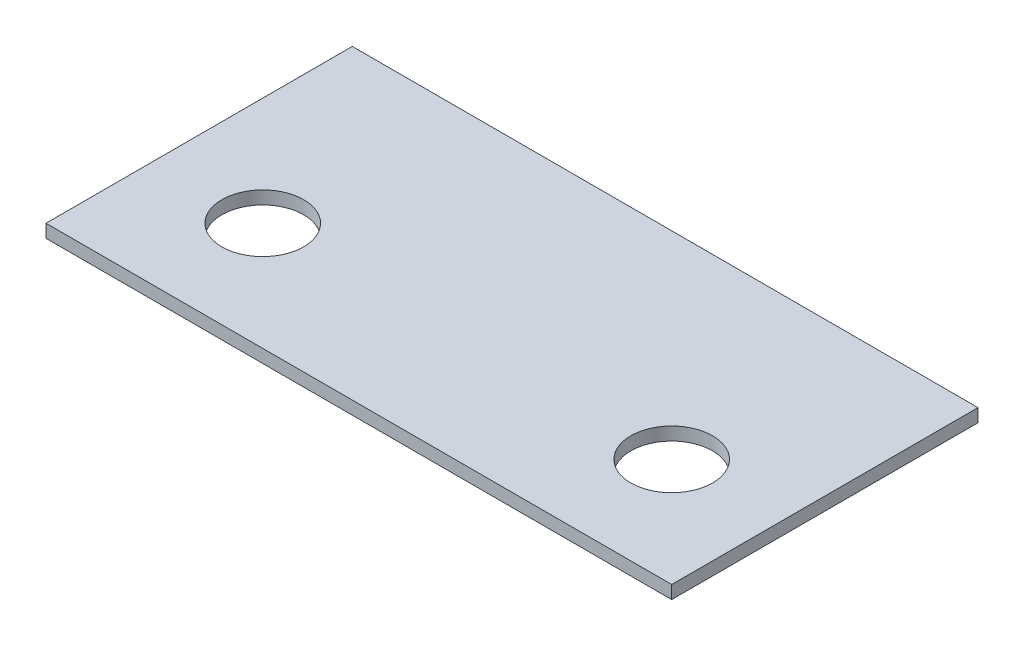
ISO-10303-21;
HEADER;
FILE_DESCRIPTION(('STEP AP214'),'2;1');
FILE_NAME('part.step','',(''),(''),'','','');
FILE_SCHEMA(('AUTOMOTIVE_DESIGN { 1 0 10303 214 1 1 1 1 }'));
ENDSEC;
DATA;
#1=APPLICATION_CONTEXT('core data for automotive mechanical design processes');
#2=APPLICATION_PROTOCOL_DEFINITION('international standard','automotive_design',2000,#1);
#3=PRODUCT_CONTEXT('',#1,'mechanical');
#4=PRODUCT('Part','Part','',(#3));
#5=PRODUCT_RELATED_PRODUCT_CATEGORY('part','',(#4));
#6=PRODUCT_DEFINITION_FORMATION('','',#4);
#7=PRODUCT_DEFINITION_CONTEXT('part definition',#1,'design');
#8=PRODUCT_DEFINITION('design','',#6,#7);
#9=PRODUCT_DEFINITION_SHAPE('','',#8);
#10=(LENGTH_UNIT() NAMED_UNIT(*) SI_UNIT(.MILLI.,.METRE.));
#11=(NAMED_UNIT(*) PLANE_ANGLE_UNIT() SI_UNIT($,.RADIAN.));
#12=(NAMED_UNIT(*) SI_UNIT($,.STERADIAN.) SOLID_ANGLE_UNIT());
#13=UNCERTAINTY_MEASURE_WITH_UNIT(LENGTH_MEASURE(1.E-05),#10,'distance_accuracy_value','');
#14=(GEOMETRIC_REPRESENTATION_CONTEXT(3) GLOBAL_UNCERTAINTY_ASSIGNED_CONTEXT((#13)) GLOBAL_UNIT_ASSIGNED_CONTEXT((#10,
#11,#12)) REPRESENTATION_CONTEXT('',''));
#15=CARTESIAN_POINT('',(0.,0.,0.));
#16=DIRECTION('',(0.,0.,1.));
#17=DIRECTION('',(1.,0.,0.));
#18=AXIS2_PLACEMENT_3D('',#15,#16,#17);
#19=CARTESIAN_POINT('',(382.5,16.,-187.25));
#20=DIRECTION('',(-1.,0.,0.));
#21=DIRECTION('',(0.,0.,1.));
#22=AXIS2_PLACEMENT_3D('',#19,#20,#21);
#23=PLANE('',#22);
#24=DIRECTION('',(0.,0.,-1.));
#25=VECTOR('',#24,1.);
#26=CARTESIAN_POINT('',(382.5,0.,-187.25));
#27=LINE('',#26,#25);
#28=CARTESIAN_POINT('',(382.5,0.,187.25));
#29=VERTEX_POINT('',#28);
#30=CARTESIAN_POINT('',(382.5,0.,-187.25));
#31=VERTEX_POINT('',#30);
#32=EDGE_CURVE('E95',#29,#31,#27,.T.);
#33=ORIENTED_EDGE('',*,*,#32,.T.);
#34=DIRECTION('',(0.,-1.,0.));
#35=VECTOR('',#34,1.);
#36=CARTESIAN_POINT('',(382.5,16.,-187.25));
#37=LINE('',#36,#35);
#38=CARTESIAN_POINT('',(382.5,16.,-187.25));
#39=VERTEX_POINT('',#38);
#40=EDGE_CURVE('E11',#39,#31,#37,.T.);
#41=ORIENTED_EDGE('',*,*,#40,.F.);
#42=DIRECTION('',(0.,0.,-1.));
#43=VECTOR('',#42,1.);
#44=CARTESIAN_POINT('',(382.5,16.,-187.25));
#45=LINE('',#44,#43);
#46=CARTESIAN_POINT('',(382.5,16.,187.25));
#47=VERTEX_POINT('',#46);
#48=EDGE_CURVE('E83',#47,#39,#45,.T.);
#49=ORIENTED_EDGE('',*,*,#48,.F.);
#50=DIRECTION('',(0.,-1.,0.));
#51=VECTOR('',#50,1.);
#52=CARTESIAN_POINT('',(382.5,16.,187.25));
#53=LINE('',#52,#51);
#54=EDGE_CURVE('E91',#47,#29,#53,.T.);
#55=ORIENTED_EDGE('',*,*,#54,.T.);
#56=EDGE_LOOP('',(#33,#41,#49,#55));
#57=FACE_BOUND('',#56,.T.);
#58=ADVANCED_FACE('F32',(#57),#23,.F.);
#59=CARTESIAN_POINT('',(-382.5,16.,-187.25));
#60=DIRECTION('',(0.,0.,1.));
#61=DIRECTION('',(1.,0.,0.));
#62=AXIS2_PLACEMENT_3D('',#59,#60,#61);
#63=PLANE('',#62);
#64=DIRECTION('',(-1.,0.,0.));
#65=VECTOR('',#64,1.);
#66=CARTESIAN_POINT('',(-382.5,0.,-187.25));
#67=LINE('',#66,#65);
#68=CARTESIAN_POINT('',(-382.5,0.,-187.25));
#69=VERTEX_POINT('',#68);
#70=EDGE_CURVE('E87',#31,#69,#67,.T.);
#71=ORIENTED_EDGE('',*,*,#70,.T.);
#72=DIRECTION('',(0.,-1.,0.));
#73=VECTOR('',#72,1.);
#74=CARTESIAN_POINT('',(-382.5,16.,-187.25));
#75=LINE('',#74,#73);
#76=CARTESIAN_POINT('',(-382.5,16.,-187.25));
#77=VERTEX_POINT('',#76);
#78=EDGE_CURVE('E40',#77,#69,#75,.T.);
#79=ORIENTED_EDGE('',*,*,#78,.F.);
#80=DIRECTION('',(-1.,0.,0.));
#81=VECTOR('',#80,1.);
#82=CARTESIAN_POINT('',(-382.5,16.,-187.25));
#83=LINE('',#82,#81);
#84=EDGE_CURVE('E78',#39,#77,#83,.T.);
#85=ORIENTED_EDGE('',*,*,#84,.F.);
#86=ORIENTED_EDGE('',*,*,#40,.T.);
#87=EDGE_LOOP('',(#71,#79,#85,#86));
#88=FACE_BOUND('',#87,.T.);
#89=ADVANCED_FACE('F86',(#88),#63,.F.);
#90=CARTESIAN_POINT('',(-382.5,16.,-187.25));
#91=DIRECTION('',(1.,0.,0.));
#92=DIRECTION('',(0.,0.,-1.));
#93=AXIS2_PLACEMENT_3D('',#90,#91,#92);
#94=PLANE('',#93);
#95=DIRECTION('',(0.,0.,1.));
#96=VECTOR('',#95,1.);
#97=CARTESIAN_POINT('',(-382.5,0.,-187.25));
#98=LINE('',#97,#96);
#99=CARTESIAN_POINT('',(-382.5,0.,187.25));
#100=VERTEX_POINT('',#99);
#101=EDGE_CURVE('E65',#69,#100,#98,.T.);
#102=ORIENTED_EDGE('',*,*,#101,.T.);
#103=DIRECTION('',(0.,-1.,0.));
#104=VECTOR('',#103,1.);
#105=CARTESIAN_POINT('',(-382.5,16.,187.25));
#106=LINE('',#105,#104);
#107=CARTESIAN_POINT('',(-382.5,16.,187.25));
#108=VERTEX_POINT('',#107);
#109=EDGE_CURVE('E88',#108,#100,#106,.T.);
#110=ORIENTED_EDGE('',*,*,#109,.F.);
#111=DIRECTION('',(0.,0.,1.));
#112=VECTOR('',#111,1.);
#113=CARTESIAN_POINT('',(-382.5,16.,-187.25));
#114=LINE('',#113,#112);
#115=EDGE_CURVE('E81',#77,#108,#114,.T.);
#116=ORIENTED_EDGE('',*,*,#115,.F.);
#117=ORIENTED_EDGE('',*,*,#78,.T.);
#118=EDGE_LOOP('',(#102,#110,#116,#117));
#119=FACE_BOUND('',#118,.T.);
#120=ADVANCED_FACE('F89',(#119),#94,.F.);
#121=CARTESIAN_POINT('',(-382.5,16.,187.25));
#122=DIRECTION('',(0.,0.,-1.));
#123=DIRECTION('',(-1.,0.,0.));
#124=AXIS2_PLACEMENT_3D('',#121,#122,#123);
#125=PLANE('',#124);
#126=DIRECTION('',(1.,0.,0.));
#127=VECTOR('',#126,1.);
#128=CARTESIAN_POINT('',(-382.5,0.,187.25));
#129=LINE('',#128,#127);
#130=EDGE_CURVE('E71',#100,#29,#129,.T.);
#131=ORIENTED_EDGE('',*,*,#130,.T.);
#132=ORIENTED_EDGE('',*,*,#54,.F.);
#133=DIRECTION('',(1.,0.,0.));
#134=VECTOR('',#133,1.);
#135=CARTESIAN_POINT('',(-382.5,16.,187.25));
#136=LINE('',#135,#134);
#137=EDGE_CURVE('E48',#108,#47,#136,.T.);
#138=ORIENTED_EDGE('',*,*,#137,.F.);
#139=ORIENTED_EDGE('',*,*,#109,.T.);
#140=EDGE_LOOP('',(#131,#132,#138,#139));
#141=FACE_BOUND('',#140,.T.);
#142=ADVANCED_FACE('F103',(#141),#125,.F.);
#143=CARTESIAN_POINT('',(0.,16.,0.));
#144=DIRECTION('',(0.,1.,0.));
#145=DIRECTION('',(0.,0.,1.));
#146=AXIS2_PLACEMENT_3D('',#143,#144,#145);
#147=PLANE('',#146);
#148=CARTESIAN_POINT('',(250.,16.,54.75));
#149=DIRECTION('',(0.,1.,0.));
#150=DIRECTION('',(0.,0.,1.));
#151=AXIS2_PLACEMENT_3D('',#148,#149,#150);
#152=CIRCLE('',#151,50.);
#153=CARTESIAN_POINT('',(250.,16.,104.75));
#154=VERTEX_POINT('',#153);
#155=EDGE_CURVE('E114',#154,#154,#152,.T.);
#156=ORIENTED_EDGE('',*,*,#155,.F.);
#157=EDGE_LOOP('',(#156));
#158=FACE_BOUND('',#157,.T.);
#159=CARTESIAN_POINT('',(-250.,16.,54.75));
#160=DIRECTION('',(0.,1.,0.));
#161=DIRECTION('',(0.,0.,1.));
#162=AXIS2_PLACEMENT_3D('',#159,#160,#161);
#163=CIRCLE('',#162,50.);
#164=CARTESIAN_POINT('',(-250.,16.,104.75));
#165=VERTEX_POINT('',#164);
#166=EDGE_CURVE('E98',#165,#165,#163,.F.);
#167=ORIENTED_EDGE('',*,*,#166,.T.);
#168=EDGE_LOOP('',(#167));
#169=FACE_BOUND('',#168,.T.);
#170=ORIENTED_EDGE('',*,*,#48,.T.);
#171=ORIENTED_EDGE('',*,*,#84,.T.);
#172=ORIENTED_EDGE('',*,*,#115,.T.);
#173=ORIENTED_EDGE('',*,*,#137,.T.);
#174=EDGE_LOOP('',(#170,#171,#172,#173));
#175=FACE_BOUND('',#174,.T.);
#176=ADVANCED_FACE('F79',(#158,#169,#175),#147,.T.);
#177=CARTESIAN_POINT('',(0.,0.,0.));
#178=DIRECTION('',(0.,1.,0.));
#179=DIRECTION('',(0.,0.,1.));
#180=AXIS2_PLACEMENT_3D('',#177,#178,#179);
#181=PLANE('',#180);
#182=CARTESIAN_POINT('',(250.,0.,54.75));
#183=DIRECTION('',(0.,1.,0.));
#184=DIRECTION('',(0.,0.,1.));
#185=AXIS2_PLACEMENT_3D('',#182,#183,#184);
#186=CIRCLE('',#185,50.);
#187=CARTESIAN_POINT('',(250.,0.,104.75));
#188=VERTEX_POINT('',#187);
#189=EDGE_CURVE('E117',#188,#188,#186,.T.);
#190=ORIENTED_EDGE('',*,*,#189,.T.);
#191=EDGE_LOOP('',(#190));
#192=FACE_BOUND('',#191,.T.);
#193=CARTESIAN_POINT('',(-250.,0.,54.75));
#194=DIRECTION('',(0.,1.,0.));
#195=DIRECTION('',(0.,0.,1.));
#196=AXIS2_PLACEMENT_3D('',#193,#194,#195);
#197=CIRCLE('',#196,50.);
#198=CARTESIAN_POINT('',(-250.,0.,104.75));
#199=VERTEX_POINT('',#198);
#200=EDGE_CURVE('E111',#199,#199,#197,.F.);
#201=ORIENTED_EDGE('',*,*,#200,.F.);
#202=EDGE_LOOP('',(#201));
#203=FACE_BOUND('',#202,.T.);
#204=ORIENTED_EDGE('',*,*,#32,.F.);
#205=ORIENTED_EDGE('',*,*,#130,.F.);
#206=ORIENTED_EDGE('',*,*,#101,.F.);
#207=ORIENTED_EDGE('',*,*,#70,.F.);
#208=EDGE_LOOP('',(#204,#205,#206,#207));
#209=FACE_BOUND('',#208,.T.);
#210=ADVANCED_FACE('F106',(#192,#203,#209),#181,.F.);
#211=CARTESIAN_POINT('',(-250.,16.000012,54.75));
#212=DIRECTION('',(0.,-1.,0.));
#213=DIRECTION('',(0.,0.,-1.));
#214=AXIS2_PLACEMENT_3D('',#211,#212,#213);
#215=CYLINDRICAL_SURFACE('',#214,50.);
#216=ORIENTED_EDGE('',*,*,#166,.F.);
#217=EDGE_LOOP('',(#216));
#218=FACE_BOUND('',#217,.T.);
#219=ORIENTED_EDGE('',*,*,#200,.T.);
#220=EDGE_LOOP('',(#219));
#221=FACE_BOUND('',#220,.T.);
#222=ADVANCED_FACE('F125',(#218,#221),#215,.F.);
#223=CARTESIAN_POINT('',(250.,16.000012,54.75));
#224=DIRECTION('',(0.,-1.,0.));
#225=DIRECTION('',(0.,0.,-1.));
#226=AXIS2_PLACEMENT_3D('',#223,#224,#225);
#227=CYLINDRICAL_SURFACE('',#226,50.);
#228=ORIENTED_EDGE('',*,*,#155,.T.);
#229=EDGE_LOOP('',(#228));
#230=FACE_BOUND('',#229,.T.);
#231=ORIENTED_EDGE('',*,*,#189,.F.);
#232=EDGE_LOOP('',(#231));
#233=FACE_BOUND('',#232,.T.);
#234=ADVANCED_FACE('F123',(#230,#233),#227,.F.);
#235=CLOSED_SHELL('',(#58,#89,#120,#142,#176,#210,#222,#234));
#236=MANIFOLD_SOLID_BREP('B2',#235);
#237=ADVANCED_BREP_SHAPE_REPRESENTATION('',(#18,#236),#14);
#238=SHAPE_DEFINITION_REPRESENTATION(#9,#237);
ENDSEC;
END-ISO-10303-21;
